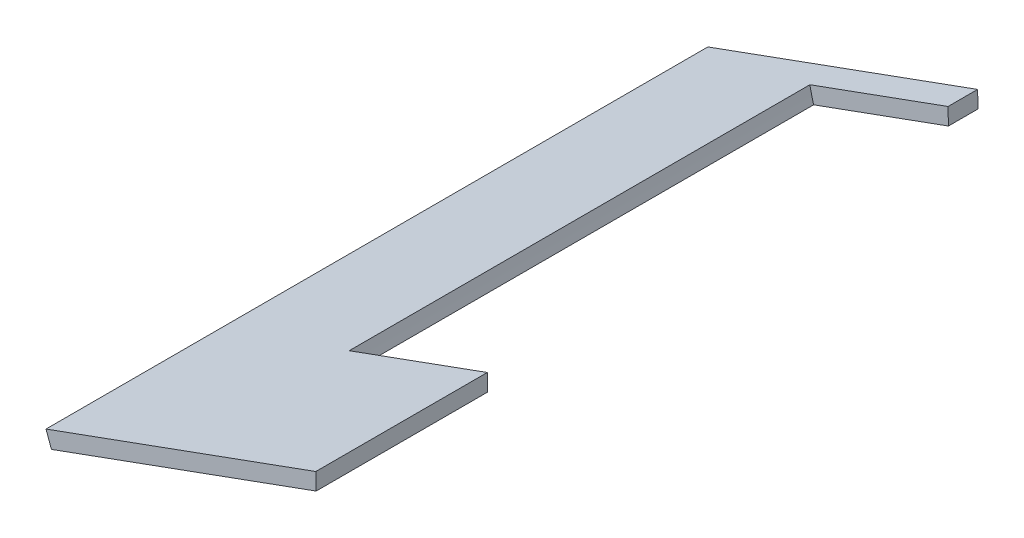
ISO-10303-21;
HEADER;
FILE_DESCRIPTION(('STEP AP214'),'2;1');
FILE_NAME('part.step','',(''),(''),'','','');
FILE_SCHEMA(('AUTOMOTIVE_DESIGN { 1 0 10303 214 1 1 1 1 }'));
ENDSEC;
DATA;
#1=APPLICATION_CONTEXT('core data for automotive mechanical design processes');
#2=APPLICATION_PROTOCOL_DEFINITION('international standard','automotive_design',2000,#1);
#3=PRODUCT_CONTEXT('',#1,'mechanical');
#4=PRODUCT('Part','Part','',(#3));
#5=PRODUCT_RELATED_PRODUCT_CATEGORY('part','',(#4));
#6=PRODUCT_DEFINITION_FORMATION('','',#4);
#7=PRODUCT_DEFINITION_CONTEXT('part definition',#1,'design');
#8=PRODUCT_DEFINITION('design','',#6,#7);
#9=PRODUCT_DEFINITION_SHAPE('','',#8);
#10=(LENGTH_UNIT() NAMED_UNIT(*) SI_UNIT(.MILLI.,.METRE.));
#11=(NAMED_UNIT(*) PLANE_ANGLE_UNIT() SI_UNIT($,.RADIAN.));
#12=(NAMED_UNIT(*) SI_UNIT($,.STERADIAN.) SOLID_ANGLE_UNIT());
#13=UNCERTAINTY_MEASURE_WITH_UNIT(LENGTH_MEASURE(1.E-05),#10,'distance_accuracy_value','');
#14=(GEOMETRIC_REPRESENTATION_CONTEXT(3) GLOBAL_UNCERTAINTY_ASSIGNED_CONTEXT((#13)) GLOBAL_UNIT_ASSIGNED_CONTEXT((#10,
#11,#12)) REPRESENTATION_CONTEXT('',''));
#15=CARTESIAN_POINT('',(0.,0.,0.));
#16=DIRECTION('',(0.,0.,1.));
#17=DIRECTION('',(1.,0.,0.));
#18=AXIS2_PLACEMENT_3D('',#15,#16,#17);
#19=CARTESIAN_POINT('',(9826.58698669695,580.153885753074,302.465815773933));
#20=DIRECTION('',(-0.34176044904666,0.939787101139096,0.));
#21=DIRECTION('',(-0.939787101139096,-0.34176044904666,0.));
#22=AXIS2_PLACEMENT_3D('',#19,#20,#21);
#23=PLANE('',#22);
#24=DIRECTION('',(0.939787101139096,0.34176044904666,0.));
#25=VECTOR('',#24,1.);
#26=CARTESIAN_POINT('',(9826.58698669695,580.153885753074,11.3100000000002));
#27=LINE('',#26,#25);
#28=CARTESIAN_POINT('',(9867.48499049439,595.026743792927,11.3100000000002));
#29=VERTEX_POINT('',#28);
#30=CARTESIAN_POINT('',(9909.90527279608,610.453189538499,11.3100000000002));
#31=VERTEX_POINT('',#30);
#32=EDGE_CURVE('E155',#29,#31,#27,.T.);
#33=ORIENTED_EDGE('',*,*,#32,.F.);
#34=DIRECTION('',(0.,0.,1.));
#35=VECTOR('',#34,1.);
#36=CARTESIAN_POINT('',(9867.48499049439,595.026743792927,11.3100000000002));
#37=LINE('',#36,#35);
#38=CARTESIAN_POINT('',(9867.48499049439,595.026743792927,156.31));
#39=VERTEX_POINT('',#38);
#40=EDGE_CURVE('E105',#29,#39,#37,.T.);
#41=ORIENTED_EDGE('',*,*,#40,.T.);
#42=DIRECTION('',(0.939787101139096,0.34176044904666,0.));
#43=VECTOR('',#42,1.);
#44=CARTESIAN_POINT('',(9826.58698669695,580.153885753074,156.31));
#45=LINE('',#44,#43);
#46=CARTESIAN_POINT('',(9909.90527279608,610.453189538499,156.31));
#47=VERTEX_POINT('',#46);
#48=EDGE_CURVE('E146',#39,#47,#45,.T.);
#49=ORIENTED_EDGE('',*,*,#48,.T.);
#50=DIRECTION('',(0.,0.,-1.));
#51=VECTOR('',#50,1.);
#52=CARTESIAN_POINT('',(9909.90527279608,610.453189538499,302.465815773933));
#53=LINE('',#52,#51);
#54=CARTESIAN_POINT('',(9909.90527279608,610.453189538499,210.295833075034));
#55=VERTEX_POINT('',#54);
#56=EDGE_CURVE('E109',#55,#47,#53,.T.);
#57=ORIENTED_EDGE('',*,*,#56,.F.);
#58=DIRECTION('',(0.939787101139096,0.34176044904666,0.));
#59=VECTOR('',#58,1.);
#60=CARTESIAN_POINT('',(9826.58698669695,580.153885753074,210.295833075034));
#61=LINE('',#60,#59);
#62=CARTESIAN_POINT('',(9826.58698669685,580.153885753038,210.295833075034));
#63=VERTEX_POINT('',#62);
#64=EDGE_CURVE('E87',#63,#55,#61,.T.);
#65=ORIENTED_EDGE('',*,*,#64,.F.);
#66=DIRECTION('',(0.,0.,-1.));
#67=VECTOR('',#66,1.);
#68=CARTESIAN_POINT('',(9826.58698669695,580.153885753074,302.465815773933));
#69=LINE('',#68,#67);
#70=CARTESIAN_POINT('',(9826.58698669695,580.153885753074,2.00000000000008));
#71=VERTEX_POINT('',#70);
#72=EDGE_CURVE('E80',#63,#71,#69,.T.);
#73=ORIENTED_EDGE('',*,*,#72,.T.);
#74=DIRECTION('',(0.939787101139096,0.34176044904666,0.));
#75=VECTOR('',#74,1.);
#76=CARTESIAN_POINT('',(9826.58698669695,580.153885753074,2.00000000000008));
#77=LINE('',#76,#75);
#78=CARTESIAN_POINT('',(9909.90527279608,610.453189538499,2.00000000000008));
#79=VERTEX_POINT('',#78);
#80=EDGE_CURVE('E84',#71,#79,#77,.T.);
#81=ORIENTED_EDGE('',*,*,#80,.T.);
#82=EDGE_CURVE('E98',#31,#79,#53,.T.);
#83=ORIENTED_EDGE('',*,*,#82,.F.);
#84=EDGE_LOOP('',(#33,#41,#49,#57,#65,#73,#81,#83));
#85=FACE_BOUND('',#84,.T.);
#86=ADVANCED_FACE('F33',(#85),#23,.F.);
#87=CARTESIAN_POINT('',(9909.78708309264,615.73056292218,302.465815773933));
#88=DIRECTION('',(-0.999749313865245,-0.0223899402851153,0.));
#89=DIRECTION('',(0.0223899402851153,-0.999749313865245,0.));
#90=AXIS2_PLACEMENT_3D('',#87,#88,#89);
#91=PLANE('',#90);
#92=DIRECTION('',(-0.0223899402851153,0.999749313865245,0.));
#93=VECTOR('',#92,1.);
#94=CARTESIAN_POINT('',(9909.78708309264,615.73056292218,11.3100000000002));
#95=LINE('',#94,#93);
#96=CARTESIAN_POINT('',(9909.78708309264,615.730562922181,11.3100000000002));
#97=VERTEX_POINT('',#96);
#98=EDGE_CURVE('E152',#31,#97,#95,.T.);
#99=ORIENTED_EDGE('',*,*,#98,.F.);
#100=ORIENTED_EDGE('',*,*,#82,.T.);
#101=DIRECTION('',(-0.0223899402851153,0.999749313865245,0.));
#102=VECTOR('',#101,1.);
#103=CARTESIAN_POINT('',(9909.78708309264,615.73056292218,2.00000000000008));
#104=LINE('',#103,#102);
#105=CARTESIAN_POINT('',(9909.78708309264,615.73056292218,2.00000000000008));
#106=VERTEX_POINT('',#105);
#107=EDGE_CURVE('E97',#79,#106,#104,.T.);
#108=ORIENTED_EDGE('',*,*,#107,.T.);
#109=DIRECTION('',(0.,0.,-1.));
#110=VECTOR('',#109,1.);
#111=CARTESIAN_POINT('',(9909.78708309264,615.73056292218,302.465815773933));
#112=LINE('',#111,#110);
#113=EDGE_CURVE('E115',#97,#106,#112,.T.);
#114=ORIENTED_EDGE('',*,*,#113,.F.);
#115=EDGE_LOOP('',(#99,#100,#108,#114));
#116=FACE_BOUND('',#115,.T.);
#117=ADVANCED_FACE('F162',(#116),#91,.F.);
#118=CARTESIAN_POINT('',(9824.87818445172,584.852821258769,302.465815773933));
#119=DIRECTION('',(0.341760449046659,-0.939787101139096,0.));
#120=DIRECTION('',(0.939787101139096,0.341760449046659,0.));
#121=AXIS2_PLACEMENT_3D('',#118,#119,#120);
#122=PLANE('',#121);
#123=DIRECTION('',(-0.939787101139096,-0.341760449046659,0.));
#124=VECTOR('',#123,1.);
#125=CARTESIAN_POINT('',(9824.87818445172,584.852821258769,11.3100000000002));
#126=LINE('',#125,#124);
#127=CARTESIAN_POINT('',(9866.30789737127,599.919039207599,11.3100000000002));
#128=VERTEX_POINT('',#127);
#129=EDGE_CURVE('E11',#97,#128,#126,.T.);
#130=ORIENTED_EDGE('',*,*,#129,.F.);
#131=ORIENTED_EDGE('',*,*,#113,.T.);
#132=DIRECTION('',(-0.939787101139096,-0.341760449046659,0.));
#133=VECTOR('',#132,1.);
#134=CARTESIAN_POINT('',(9824.87818445172,584.852821258769,2.00000000000008));
#135=LINE('',#134,#133);
#136=CARTESIAN_POINT('',(9824.87818445172,584.852821258769,2.00000000000008));
#137=VERTEX_POINT('',#136);
#138=EDGE_CURVE('E114',#106,#137,#135,.T.);
#139=ORIENTED_EDGE('',*,*,#138,.T.);
#140=DIRECTION('',(0.,0.,-1.));
#141=VECTOR('',#140,1.);
#142=CARTESIAN_POINT('',(9824.87818445172,584.852821258769,302.465815773933));
#143=LINE('',#142,#141);
#144=CARTESIAN_POINT('',(9824.87818445163,584.852821258696,210.295833075034));
#145=VERTEX_POINT('',#144);
#146=EDGE_CURVE('E102',#145,#137,#143,.T.);
#147=ORIENTED_EDGE('',*,*,#146,.F.);
#148=DIRECTION('',(-0.939787101139096,-0.341760449046659,0.));
#149=VECTOR('',#148,1.);
#150=CARTESIAN_POINT('',(9824.87818445172,584.852821258769,210.295833075034));
#151=LINE('',#150,#149);
#152=CARTESIAN_POINT('',(9909.78708309264,615.73056292218,210.295833075034));
#153=VERTEX_POINT('',#152);
#154=EDGE_CURVE('E120',#153,#145,#151,.T.);
#155=ORIENTED_EDGE('',*,*,#154,.F.);
#156=CARTESIAN_POINT('',(9909.78708309264,615.730562922181,156.31));
#157=VERTEX_POINT('',#156);
#158=EDGE_CURVE('E112',#153,#157,#112,.T.);
#159=ORIENTED_EDGE('',*,*,#158,.T.);
#160=DIRECTION('',(-0.939787101139096,-0.341760449046659,0.));
#161=VECTOR('',#160,1.);
#162=CARTESIAN_POINT('',(9824.87818445172,584.852821258769,156.31));
#163=LINE('',#162,#161);
#164=CARTESIAN_POINT('',(9866.30789737127,599.919039207599,156.31));
#165=VERTEX_POINT('',#164);
#166=EDGE_CURVE('E121',#157,#165,#163,.T.);
#167=ORIENTED_EDGE('',*,*,#166,.T.);
#168=DIRECTION('',(0.,0.,1.));
#169=VECTOR('',#168,1.);
#170=CARTESIAN_POINT('',(9866.30789737127,599.919039207599,11.3100000000002));
#171=LINE('',#170,#169);
#172=EDGE_CURVE('E41',#165,#128,#171,.F.);
#173=ORIENTED_EDGE('',*,*,#172,.T.);
#174=EDGE_LOOP('',(#130,#131,#139,#147,#155,#159,#167,#173));
#175=FACE_BOUND('',#174,.T.);
#176=ADVANCED_FACE('F127',(#175),#122,.F.);
#177=CARTESIAN_POINT('',(9824.87818445172,584.852821258769,302.465815773933));
#178=DIRECTION('',(0.939787101139124,0.341760449046583,0.));
#179=DIRECTION('',(-0.341760449046583,0.939787101139124,0.));
#180=AXIS2_PLACEMENT_3D('',#177,#178,#179);
#181=PLANE('',#180);
#182=DIRECTION('',(0.341760449046583,-0.939787101139124,0.));
#183=VECTOR('',#182,1.);
#184=CARTESIAN_POINT('',(9824.87818445172,584.852821258769,210.295833075034));
#185=LINE('',#184,#183);
#186=EDGE_CURVE('E57',#145,#63,#185,.T.);
#187=ORIENTED_EDGE('',*,*,#186,.F.);
#188=ORIENTED_EDGE('',*,*,#146,.T.);
#189=DIRECTION('',(0.341760449046583,-0.939787101139124,0.));
#190=VECTOR('',#189,1.);
#191=CARTESIAN_POINT('',(9824.87818445172,584.852821258769,2.00000000000008));
#192=LINE('',#191,#190);
#193=EDGE_CURVE('E90',#137,#71,#192,.T.);
#194=ORIENTED_EDGE('',*,*,#193,.T.);
#195=ORIENTED_EDGE('',*,*,#72,.F.);
#196=EDGE_LOOP('',(#187,#188,#194,#195));
#197=FACE_BOUND('',#196,.T.);
#198=ADVANCED_FACE('F100',(#197),#181,.F.);
#199=ORIENTED_EDGE('',*,*,#56,.T.);
#200=DIRECTION('',(-0.0223899402851153,0.999749313865245,0.));
#201=VECTOR('',#200,1.);
#202=CARTESIAN_POINT('',(9909.78708309264,615.73056292218,156.31));
#203=LINE('',#202,#201);
#204=EDGE_CURVE('E143',#47,#157,#203,.T.);
#205=ORIENTED_EDGE('',*,*,#204,.T.);
#206=ORIENTED_EDGE('',*,*,#158,.F.);
#207=DIRECTION('',(-0.0223899402851153,0.999749313865245,0.));
#208=VECTOR('',#207,1.);
#209=CARTESIAN_POINT('',(9909.78708309264,615.73056292218,210.295833075034));
#210=LINE('',#209,#208);
#211=EDGE_CURVE('E118',#55,#153,#210,.T.);
#212=ORIENTED_EDGE('',*,*,#211,.F.);
#213=EDGE_LOOP('',(#199,#205,#206,#212));
#214=FACE_BOUND('',#213,.T.);
#215=ADVANCED_FACE('F174',(#214),#91,.F.);
#216=CARTESIAN_POINT('',(0.,0.,2.00000000000008));
#217=DIRECTION('',(0.,0.,1.));
#218=DIRECTION('',(1.,0.,0.));
#219=AXIS2_PLACEMENT_3D('',#216,#217,#218);
#220=PLANE('',#219);
#221=ORIENTED_EDGE('',*,*,#193,.F.);
#222=ORIENTED_EDGE('',*,*,#138,.F.);
#223=ORIENTED_EDGE('',*,*,#107,.F.);
#224=ORIENTED_EDGE('',*,*,#80,.F.);
#225=EDGE_LOOP('',(#221,#222,#223,#224));
#226=FACE_BOUND('',#225,.T.);
#227=ADVANCED_FACE('F94',(#226),#220,.F.);
#228=CARTESIAN_POINT('',(9969.90646843519,526.930055054167,210.295833075034));
#229=DIRECTION('',(0.,0.,1.));
#230=DIRECTION('',(0.939787101139094,0.341760449046664,0.));
#231=AXIS2_PLACEMENT_3D('',#228,#229,#230);
#232=PLANE('',#231);
#233=ORIENTED_EDGE('',*,*,#64,.T.);
#234=ORIENTED_EDGE('',*,*,#211,.T.);
#235=ORIENTED_EDGE('',*,*,#154,.T.);
#236=ORIENTED_EDGE('',*,*,#186,.T.);
#237=EDGE_LOOP('',(#233,#234,#235,#236));
#238=FACE_BOUND('',#237,.T.);
#239=ADVANCED_FACE('F35',(#238),#232,.T.);
#240=CARTESIAN_POINT('',(9942.20644806408,615.592583884251,11.3100000000002));
#241=DIRECTION('',(0.,0.,1.));
#242=DIRECTION('',(1.,0.,0.));
#243=AXIS2_PLACEMENT_3D('',#240,#241,#242);
#244=CYLINDRICAL_SURFACE('',#243,77.5000000000006);
#245=CARTESIAN_POINT('',(9942.20644806408,615.592583884251,11.3100000000002));
#246=DIRECTION('',(0.,0.,1.));
#247=DIRECTION('',(1.,0.,0.));
#248=AXIS2_PLACEMENT_3D('',#245,#246,#247);
#249=CIRCLE('',#248,77.5000000000006);
#250=EDGE_CURVE('E140',#128,#29,#249,.T.);
#251=ORIENTED_EDGE('',*,*,#250,.F.);
#252=ORIENTED_EDGE('',*,*,#172,.F.);
#253=CARTESIAN_POINT('',(9942.20644806408,615.592583884251,156.31));
#254=DIRECTION('',(0.,0.,1.));
#255=DIRECTION('',(1.,0.,0.));
#256=AXIS2_PLACEMENT_3D('',#253,#254,#255);
#257=CIRCLE('',#256,77.5000000000006);
#258=EDGE_CURVE('E48',#165,#39,#257,.T.);
#259=ORIENTED_EDGE('',*,*,#258,.T.);
#260=ORIENTED_EDGE('',*,*,#40,.F.);
#261=EDGE_LOOP('',(#251,#252,#259,#260));
#262=FACE_BOUND('',#261,.T.);
#263=ADVANCED_FACE('F135',(#262),#244,.F.);
#264=CARTESIAN_POINT('',(9942.20644806408,615.592583884251,11.3100000000002));
#265=DIRECTION('',(0.,0.,1.));
#266=DIRECTION('',(1.,0.,0.));
#267=AXIS2_PLACEMENT_3D('',#264,#265,#266);
#268=PLANE('',#267);
#269=ORIENTED_EDGE('',*,*,#32,.T.);
#270=ORIENTED_EDGE('',*,*,#98,.T.);
#271=ORIENTED_EDGE('',*,*,#129,.T.);
#272=ORIENTED_EDGE('',*,*,#250,.T.);
#273=EDGE_LOOP('',(#269,#270,#271,#272));
#274=FACE_BOUND('',#273,.T.);
#275=ADVANCED_FACE('F182',(#274),#268,.T.);
#276=CARTESIAN_POINT('',(9942.20644806408,615.592583884251,156.31));
#277=DIRECTION('',(0.,0.,1.));
#278=DIRECTION('',(1.,0.,0.));
#279=AXIS2_PLACEMENT_3D('',#276,#277,#278);
#280=PLANE('',#279);
#281=ORIENTED_EDGE('',*,*,#258,.F.);
#282=ORIENTED_EDGE('',*,*,#166,.F.);
#283=ORIENTED_EDGE('',*,*,#204,.F.);
#284=ORIENTED_EDGE('',*,*,#48,.F.);
#285=EDGE_LOOP('',(#281,#282,#283,#284));
#286=FACE_BOUND('',#285,.T.);
#287=ADVANCED_FACE('F171',(#286),#280,.F.);
#288=CLOSED_SHELL('',(#86,#117,#176,#198,#215,#227,#239,#263,#275,#287));
#289=MANIFOLD_SOLID_BREP('B2',#288);
#290=ADVANCED_BREP_SHAPE_REPRESENTATION('',(#18,#289),#14);
#291=SHAPE_DEFINITION_REPRESENTATION(#9,#290);
ENDSEC;
END-ISO-10303-21;
